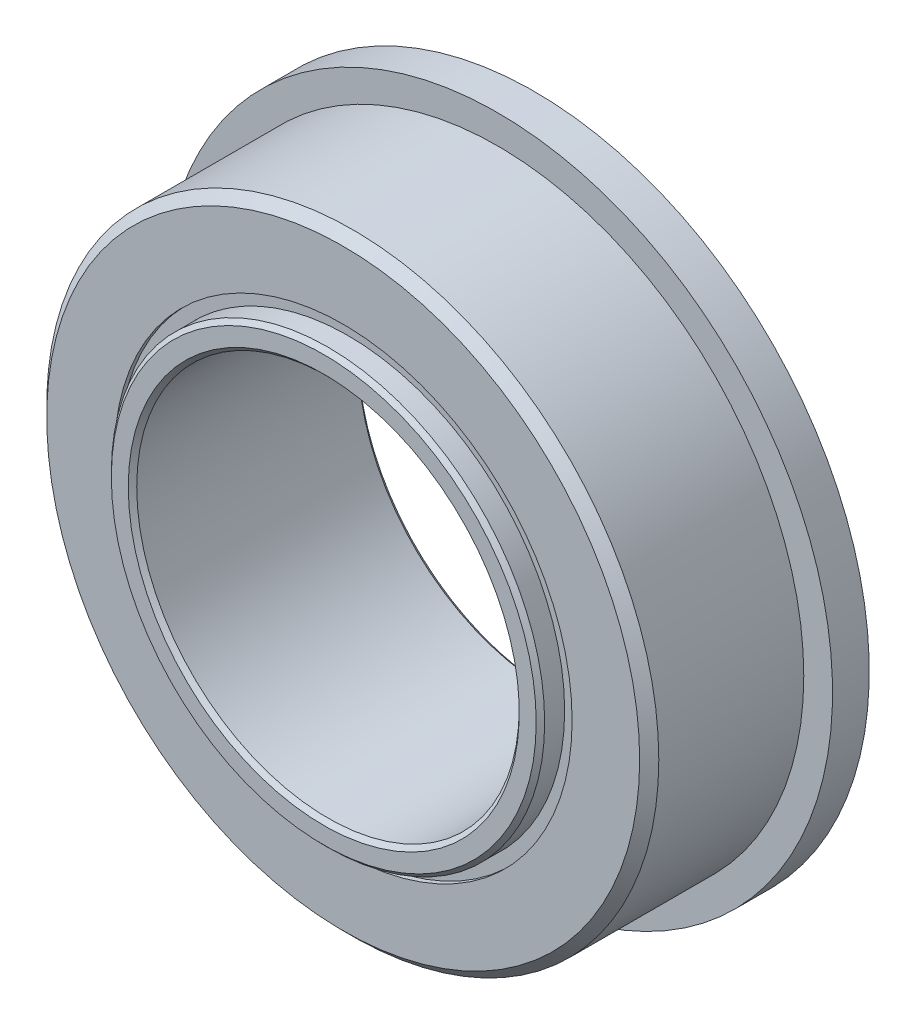
ISO-10303-21;
HEADER;
FILE_DESCRIPTION(('STEP AP214'),'2;1');
FILE_NAME('part.step','',(''),(''),'','','');
FILE_SCHEMA(('AUTOMOTIVE_DESIGN { 1 0 10303 214 1 1 1 1 }'));
ENDSEC;
DATA;
#1=APPLICATION_CONTEXT('core data for automotive mechanical design processes');
#2=APPLICATION_PROTOCOL_DEFINITION('international standard','automotive_design',2000,#1);
#3=PRODUCT_CONTEXT('',#1,'mechanical');
#4=PRODUCT('Part','Part','',(#3));
#5=PRODUCT_RELATED_PRODUCT_CATEGORY('part','',(#4));
#6=PRODUCT_DEFINITION_FORMATION('','',#4);
#7=PRODUCT_DEFINITION_CONTEXT('part definition',#1,'design');
#8=PRODUCT_DEFINITION('design','',#6,#7);
#9=PRODUCT_DEFINITION_SHAPE('','',#8);
#10=(LENGTH_UNIT() NAMED_UNIT(*) SI_UNIT(.MILLI.,.METRE.));
#11=(NAMED_UNIT(*) PLANE_ANGLE_UNIT() SI_UNIT($,.RADIAN.));
#12=(NAMED_UNIT(*) SI_UNIT($,.STERADIAN.) SOLID_ANGLE_UNIT());
#13=UNCERTAINTY_MEASURE_WITH_UNIT(LENGTH_MEASURE(1.E-05),#10,'distance_accuracy_value','');
#14=(GEOMETRIC_REPRESENTATION_CONTEXT(3) GLOBAL_UNCERTAINTY_ASSIGNED_CONTEXT((#13)) GLOBAL_UNIT_ASSIGNED_CONTEXT((#10,
#11,#12)) REPRESENTATION_CONTEXT('',''));
#15=CARTESIAN_POINT('',(0.,0.,0.));
#16=DIRECTION('',(0.,0.,1.));
#17=DIRECTION('',(1.,0.,0.));
#18=AXIS2_PLACEMENT_3D('',#15,#16,#17);
#19=CARTESIAN_POINT('',(0.,4.7498,-1.88515625));
#20=DIRECTION('',(0.,0.,1.));
#21=DIRECTION('',(1.,0.,0.));
#22=AXIS2_PLACEMENT_3D('',#19,#20,#21);
#23=PLANE('',#22);
#24=CARTESIAN_POINT('',(0.,0.,-1.88515625));
#25=DIRECTION('',(0.,0.,1.));
#26=DIRECTION('',(1.,0.,0.));
#27=AXIS2_PLACEMENT_3D('',#24,#25,#26);
#28=CIRCLE('',#27,4.7498);
#29=CARTESIAN_POINT('',(4.7498,0.,-1.88515625));
#30=VERTEX_POINT('',#29);
#31=EDGE_CURVE('E57',#30,#30,#28,.T.);
#32=ORIENTED_EDGE('',*,*,#31,.F.);
#33=EDGE_LOOP('',(#32));
#34=FACE_BOUND('',#33,.T.);
#35=CARTESIAN_POINT('',(0.,0.,-1.88515625));
#36=DIRECTION('',(0.,0.,1.));
#37=DIRECTION('',(1.,0.,0.));
#38=AXIS2_PLACEMENT_3D('',#35,#36,#37);
#39=CIRCLE('',#38,4.4958);
#40=CARTESIAN_POINT('',(4.4958,0.,-1.88515625));
#41=VERTEX_POINT('',#40);
#42=EDGE_CURVE('E11',#41,#41,#39,.T.);
#43=ORIENTED_EDGE('',*,*,#42,.T.);
#44=EDGE_LOOP('',(#43));
#45=FACE_BOUND('',#44,.T.);
#46=ADVANCED_FACE('F43',(#34,#45),#23,.F.);
#47=CARTESIAN_POINT('',(0.,0.,1.984375));
#48=DIRECTION('',(0.,0.,1.));
#49=DIRECTION('',(1.,0.,0.));
#50=AXIS2_PLACEMENT_3D('',#47,#48,#49);
#51=CYLINDRICAL_SURFACE('',#50,4.4958);
#52=ORIENTED_EDGE('',*,*,#42,.F.);
#53=EDGE_LOOP('',(#52));
#54=FACE_BOUND('',#53,.T.);
#55=CARTESIAN_POINT('',(0.,0.,-0.661458333333333));
#56=DIRECTION('',(0.,0.,1.));
#57=DIRECTION('',(1.,0.,0.));
#58=AXIS2_PLACEMENT_3D('',#55,#56,#57);
#59=CIRCLE('',#58,4.4958);
#60=CARTESIAN_POINT('',(4.4958,0.,-0.661458333333333));
#61=VERTEX_POINT('',#60);
#62=EDGE_CURVE('E49',#61,#61,#59,.T.);
#63=ORIENTED_EDGE('',*,*,#62,.T.);
#64=EDGE_LOOP('',(#63));
#65=FACE_BOUND('',#64,.T.);
#66=ADVANCED_FACE('F66',(#54,#65),#51,.F.);
#67=CARTESIAN_POINT('',(0.,4.7498,-0.661458333333333));
#68=DIRECTION('',(0.,0.,-1.));
#69=DIRECTION('',(-1.,0.,0.));
#70=AXIS2_PLACEMENT_3D('',#67,#68,#69);
#71=PLANE('',#70);
#72=ORIENTED_EDGE('',*,*,#62,.F.);
#73=EDGE_LOOP('',(#72));
#74=FACE_BOUND('',#73,.T.);
#75=CARTESIAN_POINT('',(0.,0.,-0.661458333333333));
#76=DIRECTION('',(0.,0.,1.));
#77=DIRECTION('',(1.,0.,0.));
#78=AXIS2_PLACEMENT_3D('',#75,#76,#77);
#79=CIRCLE('',#78,4.7498);
#80=CARTESIAN_POINT('',(4.7498,0.,-0.661458333333333));
#81=VERTEX_POINT('',#80);
#82=EDGE_CURVE('E53',#81,#81,#79,.T.);
#83=ORIENTED_EDGE('',*,*,#82,.T.);
#84=EDGE_LOOP('',(#83));
#85=FACE_BOUND('',#84,.T.);
#86=ADVANCED_FACE('F70',(#74,#85),#71,.F.);
#87=CARTESIAN_POINT('',(0.,0.,1.984375));
#88=DIRECTION('',(0.,0.,1.));
#89=DIRECTION('',(1.,0.,0.));
#90=AXIS2_PLACEMENT_3D('',#87,#88,#89);
#91=CYLINDRICAL_SURFACE('',#90,4.7498);
#92=ORIENTED_EDGE('',*,*,#82,.F.);
#93=EDGE_LOOP('',(#92));
#94=FACE_BOUND('',#93,.T.);
#95=ORIENTED_EDGE('',*,*,#31,.T.);
#96=EDGE_LOOP('',(#95));
#97=FACE_BOUND('',#96,.T.);
#98=ADVANCED_FACE('F63',(#94,#97),#91,.T.);
#99=CLOSED_SHELL('',(#46,#66,#86,#98));
#100=MANIFOLD_SOLID_BREP('B2',#99);
#101=CARTESIAN_POINT('',(0.,4.7498,1.88515625));
#102=DIRECTION('',(0.,0.,-1.));
#103=DIRECTION('',(-1.,0.,0.));
#104=AXIS2_PLACEMENT_3D('',#101,#102,#103);
#105=PLANE('',#104);
#106=CARTESIAN_POINT('',(0.,0.,1.88515625));
#107=DIRECTION('',(0.,0.,1.));
#108=DIRECTION('',(1.,0.,0.));
#109=AXIS2_PLACEMENT_3D('',#106,#107,#108);
#110=CIRCLE('',#109,4.4958);
#111=CARTESIAN_POINT('',(4.4958,0.,1.88515625));
#112=VERTEX_POINT('',#111);
#113=EDGE_CURVE('E42',#112,#112,#110,.T.);
#114=ORIENTED_EDGE('',*,*,#113,.F.);
#115=EDGE_LOOP('',(#114));
#116=FACE_BOUND('',#115,.T.);
#117=CARTESIAN_POINT('',(0.,0.,1.88515625));
#118=DIRECTION('',(0.,0.,1.));
#119=DIRECTION('',(1.,0.,0.));
#120=AXIS2_PLACEMENT_3D('',#117,#118,#119);
#121=CIRCLE('',#120,4.7498);
#122=CARTESIAN_POINT('',(4.7498,0.,1.88515625));
#123=VERTEX_POINT('',#122);
#124=EDGE_CURVE('E124',#123,#123,#121,.T.);
#125=ORIENTED_EDGE('',*,*,#124,.T.);
#126=EDGE_LOOP('',(#125));
#127=FACE_BOUND('',#126,.T.);
#128=ADVANCED_FACE('F110',(#116,#127),#105,.F.);
#129=CARTESIAN_POINT('',(0.,0.,1.984375));
#130=DIRECTION('',(0.,0.,1.));
#131=DIRECTION('',(1.,0.,0.));
#132=AXIS2_PLACEMENT_3D('',#129,#130,#131);
#133=CYLINDRICAL_SURFACE('',#132,4.4958);
#134=CARTESIAN_POINT('',(0.,0.,0.661458333333334));
#135=DIRECTION('',(0.,0.,1.));
#136=DIRECTION('',(1.,0.,0.));
#137=AXIS2_PLACEMENT_3D('',#134,#135,#136);
#138=CIRCLE('',#137,4.4958);
#139=CARTESIAN_POINT('',(4.4958,0.,0.661458333333334));
#140=VERTEX_POINT('',#139);
#141=EDGE_CURVE('E116',#140,#140,#138,.T.);
#142=ORIENTED_EDGE('',*,*,#141,.F.);
#143=EDGE_LOOP('',(#142));
#144=FACE_BOUND('',#143,.T.);
#145=ORIENTED_EDGE('',*,*,#113,.T.);
#146=EDGE_LOOP('',(#145));
#147=FACE_BOUND('',#146,.T.);
#148=ADVANCED_FACE('F139',(#144,#147),#133,.F.);
#149=CARTESIAN_POINT('',(0.,4.7498,0.661458333333334));
#150=DIRECTION('',(0.,0.,1.));
#151=DIRECTION('',(1.,0.,0.));
#152=AXIS2_PLACEMENT_3D('',#149,#150,#151);
#153=PLANE('',#152);
#154=CARTESIAN_POINT('',(0.,0.,0.661458333333334));
#155=DIRECTION('',(0.,0.,1.));
#156=DIRECTION('',(1.,0.,0.));
#157=AXIS2_PLACEMENT_3D('',#154,#155,#156);
#158=CIRCLE('',#157,4.7498);
#159=CARTESIAN_POINT('',(4.7498,0.,0.661458333333334));
#160=VERTEX_POINT('',#159);
#161=EDGE_CURVE('E120',#160,#160,#158,.T.);
#162=ORIENTED_EDGE('',*,*,#161,.F.);
#163=EDGE_LOOP('',(#162));
#164=FACE_BOUND('',#163,.T.);
#165=ORIENTED_EDGE('',*,*,#141,.T.);
#166=EDGE_LOOP('',(#165));
#167=FACE_BOUND('',#166,.T.);
#168=ADVANCED_FACE('F134',(#164,#167),#153,.F.);
#169=CARTESIAN_POINT('',(0.,0.,1.984375));
#170=DIRECTION('',(0.,0.,1.));
#171=DIRECTION('',(1.,0.,0.));
#172=AXIS2_PLACEMENT_3D('',#169,#170,#171);
#173=CYLINDRICAL_SURFACE('',#172,4.7498);
#174=ORIENTED_EDGE('',*,*,#124,.F.);
#175=EDGE_LOOP('',(#174));
#176=FACE_BOUND('',#175,.T.);
#177=ORIENTED_EDGE('',*,*,#161,.T.);
#178=EDGE_LOOP('',(#177));
#179=FACE_BOUND('',#178,.T.);
#180=ADVANCED_FACE('F131',(#176,#179),#173,.T.);
#181=CLOSED_SHELL('',(#128,#148,#168,#180));
#182=MANIFOLD_SOLID_BREP('B6',#181);
#183=CARTESIAN_POINT('',(-2.44686666666661,4.2380973860134,0.));
#184=DIRECTION('',(0.,0.,1.));
#185=DIRECTION('',(-0.499999999999989,0.866025403784445,0.));
#186=AXIS2_PLACEMENT_3D('',#183,#184,#185);
#187=SPHERICAL_SURFACE('',#186,0.661458333333333);
#188=CARTESIAN_POINT('',(-2.44686666666661,4.2380973860134,0.661458333333334));
#189=VERTEX_POINT('',#188);
#190=VERTEX_LOOP('',#189);
#191=FACE_BOUND('',#190,.T.);
#192=ADVANCED_FACE('F177',(#191),#187,.T.);
#193=CLOSED_SHELL('',(#192));
#194=MANIFOLD_SOLID_BREP('B37',#193);
#195=CARTESIAN_POINT('',(-4.23809738601334,2.44686666666672,0.));
#196=DIRECTION('',(0.,0.,1.));
#197=DIRECTION('',(-0.866025403784433,0.50000000000001,0.));
#198=AXIS2_PLACEMENT_3D('',#195,#196,#197);
#199=SPHERICAL_SURFACE('',#198,0.661458333333333);
#200=CARTESIAN_POINT('',(-4.23809738601334,2.44686666666672,0.661458333333334));
#201=VERTEX_POINT('',#200);
#202=VERTEX_LOOP('',#201);
#203=FACE_BOUND('',#202,.T.);
#204=ADVANCED_FACE('F197',(#203),#199,.T.);
#205=CLOSED_SHELL('',(#204));
#206=MANIFOLD_SOLID_BREP('B106',#205);
#207=CARTESIAN_POINT('',(-4.89373333333333,0.,0.));
#208=DIRECTION('',(0.,0.,1.));
#209=DIRECTION('',(-1.,0.,0.));
#210=AXIS2_PLACEMENT_3D('',#207,#208,#209);
#211=SPHERICAL_SURFACE('',#210,0.661458333333333);
#212=CARTESIAN_POINT('',(-4.89373333333333,0.,0.661458333333334));
#213=VERTEX_POINT('',#212);
#214=VERTEX_LOOP('',#213);
#215=FACE_BOUND('',#214,.T.);
#216=ADVANCED_FACE('F217',(#215),#211,.T.);
#217=CLOSED_SHELL('',(#216));
#218=MANIFOLD_SOLID_BREP('B173',#217);
#219=CARTESIAN_POINT('',(-4.23809738601339,-2.44686666666663,0.));
#220=DIRECTION('',(0.,0.,1.));
#221=DIRECTION('',(-0.866025403784443,-0.499999999999992,0.));
#222=AXIS2_PLACEMENT_3D('',#219,#220,#221);
#223=SPHERICAL_SURFACE('',#222,0.661458333333333);
#224=CARTESIAN_POINT('',(-4.23809738601339,-2.44686666666663,0.661458333333334));
#225=VERTEX_POINT('',#224);
#226=VERTEX_LOOP('',#225);
#227=FACE_BOUND('',#226,.T.);
#228=ADVANCED_FACE('F237',(#227),#223,.T.);
#229=CLOSED_SHELL('',(#228));
#230=MANIFOLD_SOLID_BREP('B193',#229);
#231=CARTESIAN_POINT('',(-2.4468666666667,-4.23809738601335,0.));
#232=DIRECTION('',(0.,0.,1.));
#233=DIRECTION('',(-0.500000000000007,-0.866025403784435,0.));
#234=AXIS2_PLACEMENT_3D('',#231,#232,#233);
#235=SPHERICAL_SURFACE('',#234,0.661458333333333);
#236=CARTESIAN_POINT('',(-2.4468666666667,-4.23809738601335,0.661458333333334));
#237=VERTEX_POINT('',#236);
#238=VERTEX_LOOP('',#237);
#239=FACE_BOUND('',#238,.T.);
#240=ADVANCED_FACE('F257',(#239),#235,.T.);
#241=CLOSED_SHELL('',(#240));
#242=MANIFOLD_SOLID_BREP('B213',#241);
#243=CARTESIAN_POINT('',(0.,-4.89373333333333,0.));
#244=DIRECTION('',(0.,0.,1.));
#245=DIRECTION('',(0.,-1.,0.));
#246=AXIS2_PLACEMENT_3D('',#243,#244,#245);
#247=SPHERICAL_SURFACE('',#246,0.661458333333333);
#248=CARTESIAN_POINT('',(0.,-4.89373333333333,0.661458333333334));
#249=VERTEX_POINT('',#248);
#250=VERTEX_LOOP('',#249);
#251=FACE_BOUND('',#250,.T.);
#252=ADVANCED_FACE('F277',(#251),#247,.T.);
#253=CLOSED_SHELL('',(#252));
#254=MANIFOLD_SOLID_BREP('B233',#253);
#255=CARTESIAN_POINT('',(2.44686666666664,-4.23809738601338,0.));
#256=DIRECTION('',(0.,0.,1.));
#257=DIRECTION('',(0.499999999999995,-0.866025403784442,0.));
#258=AXIS2_PLACEMENT_3D('',#255,#256,#257);
#259=SPHERICAL_SURFACE('',#258,0.661458333333333);
#260=CARTESIAN_POINT('',(2.44686666666664,-4.23809738601338,0.661458333333334));
#261=VERTEX_POINT('',#260);
#262=VERTEX_LOOP('',#261);
#263=FACE_BOUND('',#262,.T.);
#264=ADVANCED_FACE('F297',(#263),#259,.T.);
#265=CLOSED_SHELL('',(#264));
#266=MANIFOLD_SOLID_BREP('B253',#265);
#267=CARTESIAN_POINT('',(4.23809738601336,-2.44686666666669,0.));
#268=DIRECTION('',(0.,0.,1.));
#269=DIRECTION('',(0.866025403784436,-0.500000000000004,0.));
#270=AXIS2_PLACEMENT_3D('',#267,#268,#269);
#271=SPHERICAL_SURFACE('',#270,0.661458333333333);
#272=CARTESIAN_POINT('',(4.23809738601336,-2.44686666666669,0.661458333333334));
#273=VERTEX_POINT('',#272);
#274=VERTEX_LOOP('',#273);
#275=FACE_BOUND('',#274,.T.);
#276=ADVANCED_FACE('F317',(#275),#271,.T.);
#277=CLOSED_SHELL('',(#276));
#278=MANIFOLD_SOLID_BREP('B273',#277);
#279=CARTESIAN_POINT('',(4.89373333333333,0.,0.));
#280=DIRECTION('',(0.,0.,1.));
#281=DIRECTION('',(1.,0.,0.));
#282=AXIS2_PLACEMENT_3D('',#279,#280,#281);
#283=SPHERICAL_SURFACE('',#282,0.661458333333333);
#284=CARTESIAN_POINT('',(4.89373333333333,0.,0.661458333333334));
#285=VERTEX_POINT('',#284);
#286=VERTEX_LOOP('',#285);
#287=FACE_BOUND('',#286,.T.);
#288=ADVANCED_FACE('F337',(#287),#283,.T.);
#289=CLOSED_SHELL('',(#288));
#290=MANIFOLD_SOLID_BREP('B293',#289);
#291=CARTESIAN_POINT('',(4.23809738601337,2.44686666666666,0.));
#292=DIRECTION('',(0.,0.,1.));
#293=DIRECTION('',(0.86602540378444,0.499999999999998,0.));
#294=AXIS2_PLACEMENT_3D('',#291,#292,#293);
#295=SPHERICAL_SURFACE('',#294,0.661458333333333);
#296=CARTESIAN_POINT('',(4.23809738601337,2.44686666666666,0.661458333333334));
#297=VERTEX_POINT('',#296);
#298=VERTEX_LOOP('',#297);
#299=FACE_BOUND('',#298,.T.);
#300=ADVANCED_FACE('F357',(#299),#295,.T.);
#301=CLOSED_SHELL('',(#300));
#302=MANIFOLD_SOLID_BREP('B313',#301);
#303=CARTESIAN_POINT('',(2.44686666666667,4.23809738601336,0.));
#304=DIRECTION('',(0.,0.,1.));
#305=DIRECTION('',(0.500000000000001,0.866025403784438,0.));
#306=AXIS2_PLACEMENT_3D('',#303,#304,#305);
#307=SPHERICAL_SURFACE('',#306,0.661458333333333);
#308=CARTESIAN_POINT('',(2.44686666666667,4.23809738601336,0.661458333333334));
#309=VERTEX_POINT('',#308);
#310=VERTEX_LOOP('',#309);
#311=FACE_BOUND('',#310,.T.);
#312=ADVANCED_FACE('F377',(#311),#307,.T.);
#313=CLOSED_SHELL('',(#312));
#314=MANIFOLD_SOLID_BREP('B333',#313);
#315=CARTESIAN_POINT('',(0.,4.89373333333333,0.));
#316=DIRECTION('',(0.,0.,1.));
#317=DIRECTION('',(0.,1.,0.));
#318=AXIS2_PLACEMENT_3D('',#315,#316,#317);
#319=SPHERICAL_SURFACE('',#318,0.661458333333333);
#320=CARTESIAN_POINT('',(0.,4.89373333333333,0.661458333333334));
#321=VERTEX_POINT('',#320);
#322=VERTEX_LOOP('',#321);
#323=FACE_BOUND('',#322,.T.);
#324=ADVANCED_FACE('F399',(#323),#319,.T.);
#325=CLOSED_SHELL('',(#324));
#326=MANIFOLD_SOLID_BREP('B353',#325);
#327=CARTESIAN_POINT('',(0.,0.,1.984375));
#328=DIRECTION('',(0.,0.,1.));
#329=DIRECTION('',(1.,0.,0.));
#330=AXIS2_PLACEMENT_3D('',#327,#328,#329);
#331=CYLINDRICAL_SURFACE('',#330,4.4958);
#332=CARTESIAN_POINT('',(0.,0.,2.29975833333334));
#333=DIRECTION('',(0.,0.,-1.));
#334=DIRECTION('',(-1.,0.,0.));
#335=AXIS2_PLACEMENT_3D('',#332,#333,#334);
#336=CIRCLE('',#335,4.4958);
#337=CARTESIAN_POINT('',(-4.4958,0.,2.29975833333334));
#338=VERTEX_POINT('',#337);
#339=EDGE_CURVE('E398',#338,#338,#336,.T.);
#340=ORIENTED_EDGE('',*,*,#339,.T.);
#341=EDGE_LOOP('',(#340));
#342=FACE_BOUND('',#341,.T.);
#343=CARTESIAN_POINT('',(0.,0.,0.528371260534043));
#344=DIRECTION('',(0.,0.,1.));
#345=DIRECTION('',(1.,0.,0.));
#346=AXIS2_PLACEMENT_3D('',#343,#344,#345);
#347=CIRCLE('',#346,4.4958);
#348=CARTESIAN_POINT('',(4.4958,0.,0.528371260534043));
#349=VERTEX_POINT('',#348);
#350=EDGE_CURVE('E453',#349,#349,#347,.T.);
#351=ORIENTED_EDGE('',*,*,#350,.T.);
#352=EDGE_LOOP('',(#351));
#353=FACE_BOUND('',#352,.T.);
#354=ADVANCED_FACE('F418',(#342,#353),#331,.T.);
#355=CARTESIAN_POINT('',(0.,4.4958,2.3876));
#356=DIRECTION('',(0.,0.,-1.));
#357=DIRECTION('',(-1.,0.,0.));
#358=AXIS2_PLACEMENT_3D('',#355,#356,#357);
#359=PLANE('',#358);
#360=CARTESIAN_POINT('',(0.,0.,2.3876));
#361=DIRECTION('',(0.,0.,-1.));
#362=DIRECTION('',(-1.,0.,0.));
#363=AXIS2_PLACEMENT_3D('',#360,#361,#362);
#364=CIRCLE('',#363,4.40795833333334);
#365=CARTESIAN_POINT('',(-4.40795833333334,0.,2.3876));
#366=VERTEX_POINT('',#365);
#367=EDGE_CURVE('E425',#366,#366,#364,.F.);
#368=ORIENTED_EDGE('',*,*,#367,.T.);
#369=EDGE_LOOP('',(#368));
#370=FACE_BOUND('',#369,.T.);
#371=CARTESIAN_POINT('',(0.,0.,2.3876));
#372=DIRECTION('',(0.,0.,-1.));
#373=DIRECTION('',(-1.,0.,0.));
#374=AXIS2_PLACEMENT_3D('',#371,#372,#373);
#375=CIRCLE('',#374,4.05659166666667);
#376=CARTESIAN_POINT('',(-4.05659166666667,0.,2.3876));
#377=VERTEX_POINT('',#376);
#378=EDGE_CURVE('E429',#377,#377,#375,.T.);
#379=ORIENTED_EDGE('',*,*,#378,.T.);
#380=EDGE_LOOP('',(#379));
#381=FACE_BOUND('',#380,.T.);
#382=ADVANCED_FACE('F477',(#370,#381),#359,.F.);
#383=CARTESIAN_POINT('',(0.,0.,1.984375));
#384=DIRECTION('',(0.,0.,1.));
#385=DIRECTION('',(1.,0.,0.));
#386=AXIS2_PLACEMENT_3D('',#383,#384,#385);
#387=CYLINDRICAL_SURFACE('',#386,3.96875);
#388=CARTESIAN_POINT('',(0.,0.,-2.29975833333333));
#389=DIRECTION('',(0.,0.,1.));
#390=DIRECTION('',(1.,0.,0.));
#391=AXIS2_PLACEMENT_3D('',#388,#389,#390);
#392=CIRCLE('',#391,3.96875);
#393=CARTESIAN_POINT('',(3.96875,0.,-2.29975833333333));
#394=VERTEX_POINT('',#393);
#395=EDGE_CURVE('E438',#394,#394,#392,.F.);
#396=ORIENTED_EDGE('',*,*,#395,.T.);
#397=EDGE_LOOP('',(#396));
#398=FACE_BOUND('',#397,.T.);
#399=CARTESIAN_POINT('',(0.,0.,2.29975833333333));
#400=DIRECTION('',(0.,0.,-1.));
#401=DIRECTION('',(-1.,0.,0.));
#402=AXIS2_PLACEMENT_3D('',#399,#400,#401);
#403=CIRCLE('',#402,3.96875);
#404=CARTESIAN_POINT('',(-3.96875,0.,2.29975833333333));
#405=VERTEX_POINT('',#404);
#406=EDGE_CURVE('E441',#405,#405,#403,.F.);
#407=ORIENTED_EDGE('',*,*,#406,.T.);
#408=EDGE_LOOP('',(#407));
#409=FACE_BOUND('',#408,.T.);
#410=ADVANCED_FACE('F473',(#398,#409),#387,.F.);
#411=CARTESIAN_POINT('',(0.,3.96875,-2.3876));
#412=DIRECTION('',(0.,0.,1.));
#413=DIRECTION('',(1.,0.,0.));
#414=AXIS2_PLACEMENT_3D('',#411,#412,#413);
#415=PLANE('',#414);
#416=CARTESIAN_POINT('',(0.,0.,-2.3876));
#417=DIRECTION('',(0.,0.,1.));
#418=DIRECTION('',(1.,0.,0.));
#419=AXIS2_PLACEMENT_3D('',#416,#417,#418);
#420=CIRCLE('',#419,4.05659166666667);
#421=CARTESIAN_POINT('',(4.05659166666667,0.,-2.3876));
#422=VERTEX_POINT('',#421);
#423=EDGE_CURVE('E444',#422,#422,#420,.T.);
#424=ORIENTED_EDGE('',*,*,#423,.T.);
#425=EDGE_LOOP('',(#424));
#426=FACE_BOUND('',#425,.T.);
#427=CARTESIAN_POINT('',(0.,0.,-2.3876));
#428=DIRECTION('',(0.,0.,1.));
#429=DIRECTION('',(1.,0.,0.));
#430=AXIS2_PLACEMENT_3D('',#427,#428,#429);
#431=CIRCLE('',#430,4.40795833333333);
#432=CARTESIAN_POINT('',(4.40795833333333,0.,-2.3876));
#433=VERTEX_POINT('',#432);
#434=EDGE_CURVE('E447',#433,#433,#431,.F.);
#435=ORIENTED_EDGE('',*,*,#434,.T.);
#436=EDGE_LOOP('',(#435));
#437=FACE_BOUND('',#436,.T.);
#438=ADVANCED_FACE('F467',(#426,#437),#415,.F.);
#439=CARTESIAN_POINT('',(0.,0.,1.984375));
#440=DIRECTION('',(0.,0.,1.));
#441=DIRECTION('',(1.,0.,0.));
#442=AXIS2_PLACEMENT_3D('',#439,#440,#441);
#443=CYLINDRICAL_SURFACE('',#442,4.4958);
#444=CARTESIAN_POINT('',(0.,0.,-2.29975833333333));
#445=DIRECTION('',(0.,0.,1.));
#446=DIRECTION('',(1.,0.,0.));
#447=AXIS2_PLACEMENT_3D('',#444,#445,#446);
#448=CIRCLE('',#447,4.4958);
#449=CARTESIAN_POINT('',(4.4958,0.,-2.29975833333333));
#450=VERTEX_POINT('',#449);
#451=EDGE_CURVE('E433',#450,#450,#448,.T.);
#452=ORIENTED_EDGE('',*,*,#451,.T.);
#453=EDGE_LOOP('',(#452));
#454=FACE_BOUND('',#453,.T.);
#455=CARTESIAN_POINT('',(0.,0.,-0.528371260534042));
#456=DIRECTION('',(0.,0.,1.));
#457=DIRECTION('',(1.,0.,0.));
#458=AXIS2_PLACEMENT_3D('',#455,#456,#457);
#459=CIRCLE('',#458,4.4958);
#460=CARTESIAN_POINT('',(4.4958,0.,-0.528371260534042));
#461=VERTEX_POINT('',#460);
#462=EDGE_CURVE('E450',#461,#461,#459,.T.);
#463=ORIENTED_EDGE('',*,*,#462,.F.);
#464=EDGE_LOOP('',(#463));
#465=FACE_BOUND('',#464,.T.);
#466=ADVANCED_FACE('F462',(#454,#465),#443,.T.);
#467=CARTESIAN_POINT('',(0.,0.,0.));
#468=DIRECTION('',(0.,0.,1.));
#469=DIRECTION('',(1.,0.,0.));
#470=AXIS2_PLACEMENT_3D('',#467,#468,#469);
#471=TOROIDAL_SURFACE('',#470,4.89373333333333,0.661458333333333);
#472=ORIENTED_EDGE('',*,*,#350,.F.);
#473=EDGE_LOOP('',(#472));
#474=FACE_BOUND('',#473,.T.);
#475=ORIENTED_EDGE('',*,*,#462,.T.);
#476=EDGE_LOOP('',(#475));
#477=FACE_BOUND('',#476,.T.);
#478=ADVANCED_FACE('F458',(#474,#477),#471,.F.);
#479=CARTESIAN_POINT('',(0.,0.,-2.3876));
#480=DIRECTION('',(0.,0.,-1.));
#481=DIRECTION('',(-1.,0.,0.));
#482=AXIS2_PLACEMENT_3D('',#479,#480,#481);
#483=CONICAL_SURFACE('',#482,4.05659166666667,0.785398163397453);
#484=ORIENTED_EDGE('',*,*,#395,.F.);
#485=EDGE_LOOP('',(#484));
#486=FACE_BOUND('',#485,.T.);
#487=ORIENTED_EDGE('',*,*,#423,.F.);
#488=EDGE_LOOP('',(#487));
#489=FACE_BOUND('',#488,.T.);
#490=ADVANCED_FACE('F461',(#486,#489),#483,.F.);
#491=CARTESIAN_POINT('',(0.,0.,-2.29975833333333));
#492=DIRECTION('',(0.,0.,1.));
#493=DIRECTION('',(1.,0.,0.));
#494=AXIS2_PLACEMENT_3D('',#491,#492,#493);
#495=CONICAL_SURFACE('',#494,4.4958,0.785398163397448);
#496=ORIENTED_EDGE('',*,*,#434,.F.);
#497=EDGE_LOOP('',(#496));
#498=FACE_BOUND('',#497,.T.);
#499=ORIENTED_EDGE('',*,*,#451,.F.);
#500=EDGE_LOOP('',(#499));
#501=FACE_BOUND('',#500,.T.);
#502=ADVANCED_FACE('F487',(#498,#501),#495,.T.);
#503=CARTESIAN_POINT('',(0.,0.,2.3876));
#504=DIRECTION('',(0.,0.,-1.));
#505=DIRECTION('',(-1.,0.,0.));
#506=AXIS2_PLACEMENT_3D('',#503,#504,#505);
#507=CONICAL_SURFACE('',#506,4.40795833333334,0.785398163397458);
#508=ORIENTED_EDGE('',*,*,#339,.F.);
#509=EDGE_LOOP('',(#508));
#510=FACE_BOUND('',#509,.T.);
#511=ORIENTED_EDGE('',*,*,#367,.F.);
#512=EDGE_LOOP('',(#511));
#513=FACE_BOUND('',#512,.T.);
#514=ADVANCED_FACE('F490',(#510,#513),#507,.T.);
#515=CARTESIAN_POINT('',(0.,0.,2.29975833333333));
#516=DIRECTION('',(0.,0.,1.));
#517=DIRECTION('',(1.,0.,0.));
#518=AXIS2_PLACEMENT_3D('',#515,#516,#517);
#519=CONICAL_SURFACE('',#518,3.96875,0.785398163397443);
#520=ORIENTED_EDGE('',*,*,#378,.F.);
#521=EDGE_LOOP('',(#520));
#522=FACE_BOUND('',#521,.T.);
#523=ORIENTED_EDGE('',*,*,#406,.F.);
#524=EDGE_LOOP('',(#523));
#525=FACE_BOUND('',#524,.T.);
#526=ADVANCED_FACE('F420',(#522,#525),#519,.F.);
#527=CLOSED_SHELL('',(#354,#382,#410,#438,#466,#478,#490,#502,#514,#526));
#528=MANIFOLD_SOLID_BREP('B373',#527);
#529=CARTESIAN_POINT('',(0.,0.,1.7859375));
#530=DIRECTION('',(0.,0.,-1.));
#531=DIRECTION('',(-1.,0.,0.));
#532=AXIS2_PLACEMENT_3D('',#529,#530,#531);
#533=CONICAL_SURFACE('',#532,6.35,0.785398163397446);
#534=CARTESIAN_POINT('',(0.,0.,1.984375));
#535=DIRECTION('',(0.,0.,1.));
#536=DIRECTION('',(1.,0.,0.));
#537=AXIS2_PLACEMENT_3D('',#534,#535,#536);
#538=CIRCLE('',#537,6.1515625);
#539=CARTESIAN_POINT('',(6.1515625,0.,1.984375));
#540=VERTEX_POINT('',#539);
#541=EDGE_CURVE('E591',#540,#540,#538,.T.);
#542=ORIENTED_EDGE('',*,*,#541,.F.);
#543=EDGE_LOOP('',(#542));
#544=FACE_BOUND('',#543,.T.);
#545=CARTESIAN_POINT('',(0.,0.,1.7859375));
#546=DIRECTION('',(0.,0.,1.));
#547=DIRECTION('',(1.,0.,0.));
#548=AXIS2_PLACEMENT_3D('',#545,#546,#547);
#549=CIRCLE('',#548,6.35);
#550=CARTESIAN_POINT('',(6.35,0.,1.7859375));
#551=VERTEX_POINT('',#550);
#552=EDGE_CURVE('E417',#551,#551,#549,.T.);
#553=ORIENTED_EDGE('',*,*,#552,.T.);
#554=EDGE_LOOP('',(#553));
#555=FACE_BOUND('',#554,.T.);
#556=ADVANCED_FACE('F569',(#544,#555),#533,.T.);
#557=CARTESIAN_POINT('',(0.,0.,1.984375));
#558=DIRECTION('',(0.,0.,1.));
#559=DIRECTION('',(1.,0.,0.));
#560=AXIS2_PLACEMENT_3D('',#557,#558,#559);
#561=CYLINDRICAL_SURFACE('',#560,6.35);
#562=CARTESIAN_POINT('',(0.,0.,-1.222375));
#563=DIRECTION('',(0.,0.,1.));
#564=DIRECTION('',(1.,0.,0.));
#565=AXIS2_PLACEMENT_3D('',#562,#563,#564);
#566=CIRCLE('',#565,6.35);
#567=CARTESIAN_POINT('',(6.35,0.,-1.222375));
#568=VERTEX_POINT('',#567);
#569=EDGE_CURVE('E594',#568,#568,#566,.T.);
#570=ORIENTED_EDGE('',*,*,#569,.T.);
#571=EDGE_LOOP('',(#570));
#572=FACE_BOUND('',#571,.T.);
#573=ORIENTED_EDGE('',*,*,#552,.F.);
#574=EDGE_LOOP('',(#573));
#575=FACE_BOUND('',#574,.T.);
#576=ADVANCED_FACE('F614',(#572,#575),#561,.T.);
#577=CARTESIAN_POINT('',(0.,6.1515625,-1.984375));
#578=DIRECTION('',(0.,0.,1.));
#579=DIRECTION('',(1.,0.,0.));
#580=AXIS2_PLACEMENT_3D('',#577,#578,#579);
#581=PLANE('',#580);
#582=CARTESIAN_POINT('',(0.,0.,-1.984375));
#583=DIRECTION('',(0.,0.,1.));
#584=DIRECTION('',(1.,0.,0.));
#585=AXIS2_PLACEMENT_3D('',#582,#583,#584);
#586=CIRCLE('',#585,4.7498);
#587=CARTESIAN_POINT('',(4.7498,0.,-1.984375));
#588=VERTEX_POINT('',#587);
#589=EDGE_CURVE('E575',#588,#588,#586,.T.);
#590=ORIENTED_EDGE('',*,*,#589,.T.);
#591=EDGE_LOOP('',(#590));
#592=FACE_BOUND('',#591,.T.);
#593=CARTESIAN_POINT('',(0.,0.,-1.984375));
#594=DIRECTION('',(0.,0.,-1.));
#595=DIRECTION('',(-1.,0.,0.));
#596=AXIS2_PLACEMENT_3D('',#593,#594,#595);
#597=CIRCLE('',#596,6.9469);
#598=CARTESIAN_POINT('',(-6.9469,0.,-1.984375));
#599=VERTEX_POINT('',#598);
#600=EDGE_CURVE('E597',#599,#599,#597,.T.);
#601=ORIENTED_EDGE('',*,*,#600,.T.);
#602=EDGE_LOOP('',(#601));
#603=FACE_BOUND('',#602,.T.);
#604=ADVANCED_FACE('F617',(#592,#603),#581,.F.);
#605=CARTESIAN_POINT('',(0.,0.,1.984375));
#606=DIRECTION('',(0.,0.,1.));
#607=DIRECTION('',(1.,0.,0.));
#608=AXIS2_PLACEMENT_3D('',#605,#606,#607);
#609=CYLINDRICAL_SURFACE('',#608,4.7498);
#610=CARTESIAN_POINT('',(0.,0.,-0.645608489947016));
#611=DIRECTION('',(0.,0.,1.));
#612=DIRECTION('',(1.,0.,0.));
#613=AXIS2_PLACEMENT_3D('',#610,#611,#612);
#614=CIRCLE('',#613,4.7498);
#615=CARTESIAN_POINT('',(4.7498,0.,-0.645608489947016));
#616=VERTEX_POINT('',#615);
#617=EDGE_CURVE('E579',#616,#616,#614,.T.);
#618=ORIENTED_EDGE('',*,*,#617,.T.);
#619=EDGE_LOOP('',(#618));
#620=FACE_BOUND('',#619,.T.);
#621=ORIENTED_EDGE('',*,*,#589,.F.);
#622=EDGE_LOOP('',(#621));
#623=FACE_BOUND('',#622,.T.);
#624=ADVANCED_FACE('F622',(#620,#623),#609,.F.);
#625=CARTESIAN_POINT('',(0.,0.,0.));
#626=DIRECTION('',(0.,0.,1.));
#627=DIRECTION('',(1.,0.,0.));
#628=AXIS2_PLACEMENT_3D('',#625,#626,#627);
#629=TOROIDAL_SURFACE('',#628,4.89373333333333,0.661458333333333);
#630=ORIENTED_EDGE('',*,*,#617,.F.);
#631=EDGE_LOOP('',(#630));
#632=FACE_BOUND('',#631,.T.);
#633=CARTESIAN_POINT('',(0.,0.,0.645608489947016));
#634=DIRECTION('',(0.,0.,1.));
#635=DIRECTION('',(1.,0.,0.));
#636=AXIS2_PLACEMENT_3D('',#633,#634,#635);
#637=CIRCLE('',#636,4.7498);
#638=CARTESIAN_POINT('',(4.7498,0.,0.645608489947016));
#639=VERTEX_POINT('',#638);
#640=EDGE_CURVE('E583',#639,#639,#637,.T.);
#641=ORIENTED_EDGE('',*,*,#640,.T.);
#642=EDGE_LOOP('',(#641));
#643=FACE_BOUND('',#642,.T.);
#644=ADVANCED_FACE('F628',(#632,#643),#629,.F.);
#645=CARTESIAN_POINT('',(0.,0.,1.984375));
#646=DIRECTION('',(0.,0.,1.));
#647=DIRECTION('',(1.,0.,0.));
#648=AXIS2_PLACEMENT_3D('',#645,#646,#647);
#649=CYLINDRICAL_SURFACE('',#648,4.7498);
#650=ORIENTED_EDGE('',*,*,#640,.F.);
#651=EDGE_LOOP('',(#650));
#652=FACE_BOUND('',#651,.T.);
#653=CARTESIAN_POINT('',(0.,0.,1.984375));
#654=DIRECTION('',(0.,0.,1.));
#655=DIRECTION('',(1.,0.,0.));
#656=AXIS2_PLACEMENT_3D('',#653,#654,#655);
#657=CIRCLE('',#656,4.7498);
#658=CARTESIAN_POINT('',(4.7498,0.,1.984375));
#659=VERTEX_POINT('',#658);
#660=EDGE_CURVE('E588',#659,#659,#657,.T.);
#661=ORIENTED_EDGE('',*,*,#660,.T.);
#662=EDGE_LOOP('',(#661));
#663=FACE_BOUND('',#662,.T.);
#664=ADVANCED_FACE('F632',(#652,#663),#649,.F.);
#665=CARTESIAN_POINT('',(0.,6.1515625,1.984375));
#666=DIRECTION('',(0.,0.,-1.));
#667=DIRECTION('',(-1.,0.,0.));
#668=AXIS2_PLACEMENT_3D('',#665,#666,#667);
#669=PLANE('',#668);
#670=ORIENTED_EDGE('',*,*,#660,.F.);
#671=EDGE_LOOP('',(#670));
#672=FACE_BOUND('',#671,.T.);
#673=ORIENTED_EDGE('',*,*,#541,.T.);
#674=EDGE_LOOP('',(#673));
#675=FACE_BOUND('',#674,.T.);
#676=ADVANCED_FACE('F610',(#672,#675),#669,.F.);
#677=CARTESIAN_POINT('',(0.,4.7498,-1.222375));
#678=DIRECTION('',(0.,0.,1.));
#679=DIRECTION('',(1.,0.,0.));
#680=AXIS2_PLACEMENT_3D('',#677,#678,#679);
#681=PLANE('',#680);
#682=CARTESIAN_POINT('',(0.,0.,-1.222375));
#683=DIRECTION('',(0.,0.,-1.));
#684=DIRECTION('',(-1.,0.,0.));
#685=AXIS2_PLACEMENT_3D('',#682,#683,#684);
#686=CIRCLE('',#685,6.9469);
#687=CARTESIAN_POINT('',(-6.9469,0.,-1.222375));
#688=VERTEX_POINT('',#687);
#689=EDGE_CURVE('E600',#688,#688,#686,.T.);
#690=ORIENTED_EDGE('',*,*,#689,.F.);
#691=EDGE_LOOP('',(#690));
#692=FACE_BOUND('',#691,.T.);
#693=ORIENTED_EDGE('',*,*,#569,.F.);
#694=EDGE_LOOP('',(#693));
#695=FACE_BOUND('',#694,.T.);
#696=ADVANCED_FACE('F607',(#692,#695),#681,.T.);
#697=CARTESIAN_POINT('',(0.,0.,-1.984375));
#698=DIRECTION('',(0.,0.,-1.));
#699=DIRECTION('',(-1.,0.,0.));
#700=AXIS2_PLACEMENT_3D('',#697,#698,#699);
#701=CYLINDRICAL_SURFACE('',#700,6.9469);
#702=ORIENTED_EDGE('',*,*,#689,.T.);
#703=EDGE_LOOP('',(#702));
#704=FACE_BOUND('',#703,.T.);
#705=ORIENTED_EDGE('',*,*,#600,.F.);
#706=EDGE_LOOP('',(#705));
#707=FACE_BOUND('',#706,.T.);
#708=ADVANCED_FACE('F604',(#704,#707),#701,.T.);
#709=CLOSED_SHELL('',(#556,#576,#604,#624,#644,#664,#676,#696,#708));
#710=MANIFOLD_SOLID_BREP('B393',#709);
#711=ADVANCED_BREP_SHAPE_REPRESENTATION('',(#18,#100,#182,#194,#206,#218,#230,#242,#254,#266,
#278,#290,#302,#314,#326,#528,#710),#14);
#712=SHAPE_DEFINITION_REPRESENTATION(#9,#711);
ENDSEC;
END-ISO-10303-21;
